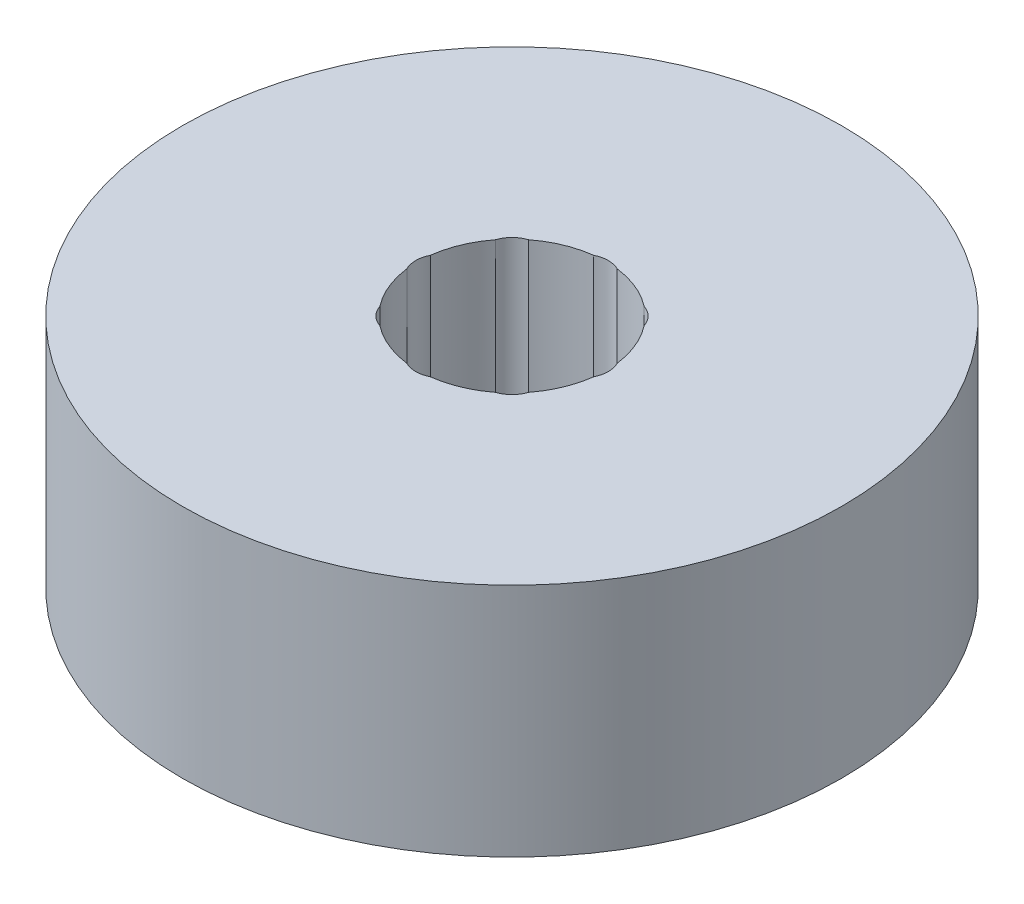
ISO-10303-21;
HEADER;
FILE_DESCRIPTION(('STEP AP214'),'2;1');
FILE_NAME('part.step','',(''),(''),'','','');
FILE_SCHEMA(('AUTOMOTIVE_DESIGN { 1 0 10303 214 1 1 1 1 }'));
ENDSEC;
DATA;
#1=APPLICATION_CONTEXT('core data for automotive mechanical design processes');
#2=APPLICATION_PROTOCOL_DEFINITION('international standard','automotive_design',2000,#1);
#3=PRODUCT_CONTEXT('',#1,'mechanical');
#4=PRODUCT('Part','Part','',(#3));
#5=PRODUCT_RELATED_PRODUCT_CATEGORY('part','',(#4));
#6=PRODUCT_DEFINITION_FORMATION('','',#4);
#7=PRODUCT_DEFINITION_CONTEXT('part definition',#1,'design');
#8=PRODUCT_DEFINITION('design','',#6,#7);
#9=PRODUCT_DEFINITION_SHAPE('','',#8);
#10=(LENGTH_UNIT() NAMED_UNIT(*) SI_UNIT(.MILLI.,.METRE.));
#11=(NAMED_UNIT(*) PLANE_ANGLE_UNIT() SI_UNIT($,.RADIAN.));
#12=(NAMED_UNIT(*) SI_UNIT($,.STERADIAN.) SOLID_ANGLE_UNIT());
#13=UNCERTAINTY_MEASURE_WITH_UNIT(LENGTH_MEASURE(1.E-05),#10,'distance_accuracy_value','');
#14=(GEOMETRIC_REPRESENTATION_CONTEXT(3) GLOBAL_UNCERTAINTY_ASSIGNED_CONTEXT((#13)) GLOBAL_UNIT_ASSIGNED_CONTEXT((#10,
#11,#12)) REPRESENTATION_CONTEXT('',''));
#15=CARTESIAN_POINT('',(0.,0.,0.));
#16=DIRECTION('',(0.,0.,1.));
#17=DIRECTION('',(1.,0.,0.));
#18=AXIS2_PLACEMENT_3D('',#15,#16,#17);
#19=CARTESIAN_POINT('',(0.,25.,0.));
#20=DIRECTION('',(0.,-1.,0.));
#21=DIRECTION('',(0.,0.,-1.));
#22=AXIS2_PLACEMENT_3D('',#19,#20,#21);
#23=CYLINDRICAL_SURFACE('',#22,35.);
#24=CARTESIAN_POINT('',(0.,25.,0.));
#25=DIRECTION('',(0.,1.,0.));
#26=DIRECTION('',(0.,0.,1.));
#27=AXIS2_PLACEMENT_3D('',#24,#25,#26);
#28=CIRCLE('',#27,35.);
#29=CARTESIAN_POINT('',(0.,25.,35.));
#30=VERTEX_POINT('',#29);
#31=EDGE_CURVE('E190',#30,#30,#28,.T.);
#32=ORIENTED_EDGE('',*,*,#31,.F.);
#33=EDGE_LOOP('',(#32));
#34=FACE_BOUND('',#33,.T.);
#35=CARTESIAN_POINT('',(0.,0.,0.));
#36=DIRECTION('',(0.,1.,0.));
#37=DIRECTION('',(0.,0.,1.));
#38=AXIS2_PLACEMENT_3D('',#35,#36,#37);
#39=CIRCLE('',#38,35.);
#40=CARTESIAN_POINT('',(0.,0.,35.));
#41=VERTEX_POINT('',#40);
#42=EDGE_CURVE('E181',#41,#41,#39,.T.);
#43=ORIENTED_EDGE('',*,*,#42,.T.);
#44=EDGE_LOOP('',(#43));
#45=FACE_BOUND('',#44,.T.);
#46=ADVANCED_FACE('F39',(#34,#45),#23,.T.);
#47=CARTESIAN_POINT('',(0.,25.,0.));
#48=DIRECTION('',(0.,1.,0.));
#49=DIRECTION('',(0.,0.,1.));
#50=AXIS2_PLACEMENT_3D('',#47,#48,#49);
#51=PLANE('',#50);
#52=CARTESIAN_POINT('',(7.44047920707784,25.,0.));
#53=DIRECTION('',(0.,1.,0.));
#54=DIRECTION('',(0.,0.,-1.));
#55=AXIS2_PLACEMENT_3D('',#52,#53,#54);
#56=CIRCLE('',#55,2.77739005515061);
#57=CARTESIAN_POINT('',(9.92186331036699,25.,1.24764916959594));
#58=VERTEX_POINT('',#57);
#59=CARTESIAN_POINT('',(9.92186331036699,25.,-1.24764916959594));
#60=VERTEX_POINT('',#59);
#61=EDGE_CURVE('E257',#58,#60,#56,.T.);
#62=ORIENTED_EDGE('',*,*,#61,.F.);
#63=CARTESIAN_POINT('',(0.,25.,0.));
#64=DIRECTION('',(0.,1.,0.));
#65=DIRECTION('',(0.,0.,1.));
#66=AXIS2_PLACEMENT_3D('',#63,#64,#65);
#67=CIRCLE('',#66,10.);
#68=CARTESIAN_POINT('',(7.89803801712959,25.,6.13359564040341));
#69=VERTEX_POINT('',#68);
#70=EDGE_CURVE('E336',#69,#58,#67,.T.);
#71=ORIENTED_EDGE('',*,*,#70,.F.);
#72=CARTESIAN_POINT('',(5.26121330260227,25.,5.26121330260222));
#73=DIRECTION('',(0.,1.,0.));
#74=DIRECTION('',(0.707106781186544,0.,-0.707106781186551));
#75=AXIS2_PLACEMENT_3D('',#72,#73,#74);
#76=CIRCLE('',#75,2.77739005515061);
#77=CARTESIAN_POINT('',(6.13359564040349,25.,7.89803801712952));
#78=VERTEX_POINT('',#77);
#79=EDGE_CURVE('E327',#78,#69,#76,.T.);
#80=ORIENTED_EDGE('',*,*,#79,.F.);
#81=CARTESIAN_POINT('',(1.24764916959597,25.,9.92186331036699));
#82=VERTEX_POINT('',#81);
#83=EDGE_CURVE('E188',#82,#78,#67,.T.);
#84=ORIENTED_EDGE('',*,*,#83,.F.);
#85=CARTESIAN_POINT('',(0.,25.,7.44047920707784));
#86=DIRECTION('',(0.,1.,0.));
#87=DIRECTION('',(1.,0.,0.));
#88=AXIS2_PLACEMENT_3D('',#85,#86,#87);
#89=CIRCLE('',#88,2.77739005515061);
#90=CARTESIAN_POINT('',(-1.2476491695959,25.,9.92186331036699));
#91=VERTEX_POINT('',#90);
#92=EDGE_CURVE('E330',#91,#82,#89,.T.);
#93=ORIENTED_EDGE('',*,*,#92,.F.);
#94=CARTESIAN_POINT('',(-6.13359564040344,25.,7.89803801712957));
#95=VERTEX_POINT('',#94);
#96=EDGE_CURVE('E172',#95,#91,#67,.T.);
#97=ORIENTED_EDGE('',*,*,#96,.F.);
#98=CARTESIAN_POINT('',(-5.26121330260224,25.,5.26121330260225));
#99=DIRECTION('',(0.,1.,0.));
#100=DIRECTION('',(0.707106781186549,0.,0.707106781186546));
#101=AXIS2_PLACEMENT_3D('',#98,#99,#100);
#102=CIRCLE('',#101,2.77739005515061);
#103=CARTESIAN_POINT('',(-7.89803801712954,25.,6.13359564040347));
#104=VERTEX_POINT('',#103);
#105=EDGE_CURVE('E152',#104,#95,#102,.T.);
#106=ORIENTED_EDGE('',*,*,#105,.F.);
#107=CARTESIAN_POINT('',(-9.92186331036699,25.,1.24764916959594));
#108=VERTEX_POINT('',#107);
#109=EDGE_CURVE('E168',#108,#104,#67,.T.);
#110=ORIENTED_EDGE('',*,*,#109,.F.);
#111=CARTESIAN_POINT('',(-7.44047920707784,25.,0.));
#112=DIRECTION('',(0.,1.,0.));
#113=DIRECTION('',(0.,0.,1.));
#114=AXIS2_PLACEMENT_3D('',#111,#112,#113);
#115=CIRCLE('',#114,2.77739005515061);
#116=CARTESIAN_POINT('',(-9.92186331036699,25.,-1.24764916959594));
#117=VERTEX_POINT('',#116);
#118=EDGE_CURVE('E204',#117,#108,#115,.T.);
#119=ORIENTED_EDGE('',*,*,#118,.F.);
#120=CARTESIAN_POINT('',(-7.89803801712963,25.,-6.13359564040336));
#121=VERTEX_POINT('',#120);
#122=EDGE_CURVE('E183',#121,#117,#67,.T.);
#123=ORIENTED_EDGE('',*,*,#122,.F.);
#124=CARTESIAN_POINT('',(-5.26121330260231,25.,-5.26121330260218));
#125=DIRECTION('',(0.,1.,0.));
#126=DIRECTION('',(-0.707106781186539,0.,0.707106781186556));
#127=AXIS2_PLACEMENT_3D('',#124,#125,#126);
#128=CIRCLE('',#127,2.77739005515061);
#129=CARTESIAN_POINT('',(-6.13359564040355,25.,-7.89803801712948));
#130=VERTEX_POINT('',#129);
#131=EDGE_CURVE('E347',#130,#121,#128,.T.);
#132=ORIENTED_EDGE('',*,*,#131,.F.);
#133=CARTESIAN_POINT('',(-1.24764916959604,25.,-9.92186331036697));
#134=VERTEX_POINT('',#133);
#135=EDGE_CURVE('E195',#134,#130,#67,.T.);
#136=ORIENTED_EDGE('',*,*,#135,.F.);
#137=CARTESIAN_POINT('',(0.,25.,-7.44047920707784));
#138=DIRECTION('',(0.,1.,0.));
#139=DIRECTION('',(-1.,0.,0.));
#140=AXIS2_PLACEMENT_3D('',#137,#138,#139);
#141=CIRCLE('',#140,2.77739005515061);
#142=CARTESIAN_POINT('',(1.24764916959583,25.,-9.921863310367));
#143=VERTEX_POINT('',#142);
#144=EDGE_CURVE('E360',#143,#134,#141,.T.);
#145=ORIENTED_EDGE('',*,*,#144,.F.);
#146=CARTESIAN_POINT('',(6.13359564040339,25.,-7.89803801712961));
#147=VERTEX_POINT('',#146);
#148=EDGE_CURVE('E200',#147,#143,#67,.T.);
#149=ORIENTED_EDGE('',*,*,#148,.F.);
#150=CARTESIAN_POINT('',(5.2612133026022,25.,-5.26121330260229));
#151=DIRECTION('',(0.,1.,0.));
#152=DIRECTION('',(-0.707106781186554,0.,-0.707106781186541));
#153=AXIS2_PLACEMENT_3D('',#150,#151,#152);
#154=CIRCLE('',#153,2.77739005515061);
#155=CARTESIAN_POINT('',(7.8980380171295,25.,-6.13359564040352));
#156=VERTEX_POINT('',#155);
#157=EDGE_CURVE('E363',#156,#147,#154,.T.);
#158=ORIENTED_EDGE('',*,*,#157,.F.);
#159=EDGE_CURVE('E367',#60,#156,#67,.T.);
#160=ORIENTED_EDGE('',*,*,#159,.F.);
#161=EDGE_LOOP('',(#62,#71,#80,#84,#93,#97,#106,#110,#119,#123,#132,#136,#145,#149,#158,#160));
#162=FACE_BOUND('',#161,.T.);
#163=ORIENTED_EDGE('',*,*,#31,.T.);
#164=EDGE_LOOP('',(#163));
#165=FACE_BOUND('',#164,.T.);
#166=ADVANCED_FACE('F170',(#162,#165),#51,.T.);
#167=CARTESIAN_POINT('',(0.,0.,0.));
#168=DIRECTION('',(0.,1.,0.));
#169=DIRECTION('',(0.,0.,1.));
#170=AXIS2_PLACEMENT_3D('',#167,#168,#169);
#171=PLANE('',#170);
#172=CARTESIAN_POINT('',(0.,0.,0.));
#173=DIRECTION('',(0.,1.,0.));
#174=DIRECTION('',(0.,0.,1.));
#175=AXIS2_PLACEMENT_3D('',#172,#173,#174);
#176=CIRCLE('',#175,10.);
#177=CARTESIAN_POINT('',(0.,0.,10.));
#178=VERTEX_POINT('',#177);
#179=EDGE_CURVE('E192',#178,#178,#176,.T.);
#180=ORIENTED_EDGE('',*,*,#179,.T.);
#181=EDGE_LOOP('',(#180));
#182=FACE_BOUND('',#181,.T.);
#183=ORIENTED_EDGE('',*,*,#42,.F.);
#184=EDGE_LOOP('',(#183));
#185=FACE_BOUND('',#184,.T.);
#186=ADVANCED_FACE('F276',(#182,#185),#171,.F.);
#187=CARTESIAN_POINT('',(0.,25.,0.));
#188=DIRECTION('',(0.,-1.,0.));
#189=DIRECTION('',(0.,0.,-1.));
#190=AXIS2_PLACEMENT_3D('',#187,#188,#189);
#191=CYLINDRICAL_SURFACE('',#190,10.);
#192=DIRECTION('',(0.,1.,0.));
#193=VECTOR('',#192,1.);
#194=CARTESIAN_POINT('',(9.92186331036699,15.818184822182,1.24764916959594));
#195=LINE('',#194,#193);
#196=CARTESIAN_POINT('',(9.92186331036699,6.63636964436409,1.24764916959594));
#197=VERTEX_POINT('',#196);
#198=EDGE_CURVE('E11',#197,#58,#195,.T.);
#199=ORIENTED_EDGE('',*,*,#198,.F.);
#200=CARTESIAN_POINT('',(0.,6.63636964436409,0.));
#201=DIRECTION('',(0.,1.,0.));
#202=DIRECTION('',(0.,0.,1.));
#203=AXIS2_PLACEMENT_3D('',#200,#201,#202);
#204=CIRCLE('',#203,10.);
#205=CARTESIAN_POINT('',(9.92186331036699,6.63636964436409,-1.24764916959594));
#206=VERTEX_POINT('',#205);
#207=EDGE_CURVE('E254',#197,#206,#204,.T.);
#208=ORIENTED_EDGE('',*,*,#207,.T.);
#209=DIRECTION('',(0.,1.,0.));
#210=VECTOR('',#209,1.);
#211=CARTESIAN_POINT('',(9.92186331036699,15.818184822182,-1.24764916959594));
#212=LINE('',#211,#210);
#213=EDGE_CURVE('E46',#60,#206,#212,.F.);
#214=ORIENTED_EDGE('',*,*,#213,.F.);
#215=ORIENTED_EDGE('',*,*,#159,.T.);
#216=DIRECTION('',(0.,1.,0.));
#217=VECTOR('',#216,1.);
#218=CARTESIAN_POINT('',(7.8980380171295,15.818184822182,-6.13359564040352));
#219=LINE('',#218,#217);
#220=CARTESIAN_POINT('',(7.8980380171295,6.63636964436409,-6.13359564040352));
#221=VERTEX_POINT('',#220);
#222=EDGE_CURVE('E251',#221,#156,#219,.T.);
#223=ORIENTED_EDGE('',*,*,#222,.F.);
#224=CARTESIAN_POINT('',(0.,6.63636964436409,0.));
#225=DIRECTION('',(0.,1.,0.));
#226=DIRECTION('',(0.,0.,1.));
#227=AXIS2_PLACEMENT_3D('',#224,#225,#226);
#228=CIRCLE('',#227,10.);
#229=CARTESIAN_POINT('',(6.13359564040339,6.63636964436409,-7.89803801712961));
#230=VERTEX_POINT('',#229);
#231=EDGE_CURVE('E247',#221,#230,#228,.T.);
#232=ORIENTED_EDGE('',*,*,#231,.T.);
#233=DIRECTION('',(0.,1.,0.));
#234=VECTOR('',#233,1.);
#235=CARTESIAN_POINT('',(6.13359564040338,15.818184822182,-7.89803801712961));
#236=LINE('',#235,#234);
#237=EDGE_CURVE('E253',#147,#230,#236,.F.);
#238=ORIENTED_EDGE('',*,*,#237,.F.);
#239=ORIENTED_EDGE('',*,*,#148,.T.);
#240=DIRECTION('',(0.,1.,0.));
#241=VECTOR('',#240,1.);
#242=CARTESIAN_POINT('',(1.24764916959583,15.818184822182,-9.921863310367));
#243=LINE('',#242,#241);
#244=CARTESIAN_POINT('',(1.24764916959583,6.63636964436409,-9.921863310367));
#245=VERTEX_POINT('',#244);
#246=EDGE_CURVE('E225',#245,#143,#243,.T.);
#247=ORIENTED_EDGE('',*,*,#246,.F.);
#248=CARTESIAN_POINT('',(0.,6.63636964436409,0.));
#249=DIRECTION('',(0.,1.,0.));
#250=DIRECTION('',(0.,0.,1.));
#251=AXIS2_PLACEMENT_3D('',#248,#249,#250);
#252=CIRCLE('',#251,10.);
#253=CARTESIAN_POINT('',(-1.24764916959604,6.63636964436409,-9.92186331036697));
#254=VERTEX_POINT('',#253);
#255=EDGE_CURVE('E159',#245,#254,#252,.T.);
#256=ORIENTED_EDGE('',*,*,#255,.T.);
#257=DIRECTION('',(0.,1.,0.));
#258=VECTOR('',#257,1.);
#259=CARTESIAN_POINT('',(-1.24764916959604,15.818184822182,-9.92186331036697));
#260=LINE('',#259,#258);
#261=EDGE_CURVE('E218',#134,#254,#260,.F.);
#262=ORIENTED_EDGE('',*,*,#261,.F.);
#263=ORIENTED_EDGE('',*,*,#135,.T.);
#264=DIRECTION('',(0.,1.,0.));
#265=VECTOR('',#264,1.);
#266=CARTESIAN_POINT('',(-6.13359564040355,15.818184822182,-7.89803801712948));
#267=LINE('',#266,#265);
#268=CARTESIAN_POINT('',(-6.13359564040355,6.63636964436409,-7.89803801712948));
#269=VERTEX_POINT('',#268);
#270=EDGE_CURVE('E229',#269,#130,#267,.T.);
#271=ORIENTED_EDGE('',*,*,#270,.F.);
#272=CARTESIAN_POINT('',(0.,6.63636964436409,0.));
#273=DIRECTION('',(0.,1.,0.));
#274=DIRECTION('',(0.,0.,1.));
#275=AXIS2_PLACEMENT_3D('',#272,#273,#274);
#276=CIRCLE('',#275,10.);
#277=CARTESIAN_POINT('',(-7.89803801712963,6.63636964436409,-6.13359564040336));
#278=VERTEX_POINT('',#277);
#279=EDGE_CURVE('E221',#269,#278,#276,.T.);
#280=ORIENTED_EDGE('',*,*,#279,.T.);
#281=DIRECTION('',(0.,1.,0.));
#282=VECTOR('',#281,1.);
#283=CARTESIAN_POINT('',(-7.89803801712963,15.818184822182,-6.13359564040336));
#284=LINE('',#283,#282);
#285=EDGE_CURVE('E230',#121,#278,#284,.F.);
#286=ORIENTED_EDGE('',*,*,#285,.F.);
#287=ORIENTED_EDGE('',*,*,#122,.T.);
#288=DIRECTION('',(0.,1.,0.));
#289=VECTOR('',#288,1.);
#290=CARTESIAN_POINT('',(-9.92186331036699,15.818184822182,-1.24764916959594));
#291=LINE('',#290,#289);
#292=CARTESIAN_POINT('',(-9.92186331036699,6.63636964436409,-1.24764916959594));
#293=VERTEX_POINT('',#292);
#294=EDGE_CURVE('E215',#293,#117,#291,.T.);
#295=ORIENTED_EDGE('',*,*,#294,.F.);
#296=CARTESIAN_POINT('',(0.,6.63636964436409,0.));
#297=DIRECTION('',(0.,1.,0.));
#298=DIRECTION('',(0.,0.,1.));
#299=AXIS2_PLACEMENT_3D('',#296,#297,#298);
#300=CIRCLE('',#299,10.);
#301=CARTESIAN_POINT('',(-9.92186331036699,6.63636964436409,1.24764916959594));
#302=VERTEX_POINT('',#301);
#303=EDGE_CURVE('E208',#293,#302,#300,.T.);
#304=ORIENTED_EDGE('',*,*,#303,.T.);
#305=DIRECTION('',(0.,1.,0.));
#306=VECTOR('',#305,1.);
#307=CARTESIAN_POINT('',(-9.92186331036699,15.818184822182,1.24764916959594));
#308=LINE('',#307,#306);
#309=EDGE_CURVE('E185',#108,#302,#308,.F.);
#310=ORIENTED_EDGE('',*,*,#309,.F.);
#311=ORIENTED_EDGE('',*,*,#109,.T.);
#312=DIRECTION('',(0.,1.,0.));
#313=VECTOR('',#312,1.);
#314=CARTESIAN_POINT('',(-7.89803801712955,15.818184822182,6.13359564040347));
#315=LINE('',#314,#313);
#316=CARTESIAN_POINT('',(-7.89803801712954,6.63636964436409,6.13359564040347));
#317=VERTEX_POINT('',#316);
#318=EDGE_CURVE('E147',#317,#104,#315,.T.);
#319=ORIENTED_EDGE('',*,*,#318,.F.);
#320=CARTESIAN_POINT('',(0.,6.63636964436409,0.));
#321=DIRECTION('',(0.,1.,0.));
#322=DIRECTION('',(0.,0.,1.));
#323=AXIS2_PLACEMENT_3D('',#320,#321,#322);
#324=CIRCLE('',#323,10.);
#325=CARTESIAN_POINT('',(-6.13359564040344,6.63636964436409,7.89803801712957));
#326=VERTEX_POINT('',#325);
#327=EDGE_CURVE('E212',#317,#326,#324,.T.);
#328=ORIENTED_EDGE('',*,*,#327,.T.);
#329=DIRECTION('',(0.,1.,0.));
#330=VECTOR('',#329,1.);
#331=CARTESIAN_POINT('',(-6.13359564040344,15.818184822182,7.89803801712957));
#332=LINE('',#331,#330);
#333=EDGE_CURVE('E161',#95,#326,#332,.F.);
#334=ORIENTED_EDGE('',*,*,#333,.F.);
#335=ORIENTED_EDGE('',*,*,#96,.T.);
#336=DIRECTION('',(0.,1.,0.));
#337=VECTOR('',#336,1.);
#338=CARTESIAN_POINT('',(-1.2476491695959,15.818184822182,9.92186331036699));
#339=LINE('',#338,#337);
#340=CARTESIAN_POINT('',(-1.2476491695959,6.63636964436409,9.92186331036699));
#341=VERTEX_POINT('',#340);
#342=EDGE_CURVE('E246',#341,#91,#339,.T.);
#343=ORIENTED_EDGE('',*,*,#342,.F.);
#344=CARTESIAN_POINT('',(0.,6.63636964436409,0.));
#345=DIRECTION('',(0.,1.,0.));
#346=DIRECTION('',(0.,0.,1.));
#347=AXIS2_PLACEMENT_3D('',#344,#345,#346);
#348=CIRCLE('',#347,10.);
#349=CARTESIAN_POINT('',(1.24764916959597,6.63636964436409,9.92186331036699));
#350=VERTEX_POINT('',#349);
#351=EDGE_CURVE('E238',#341,#350,#348,.T.);
#352=ORIENTED_EDGE('',*,*,#351,.T.);
#353=DIRECTION('',(0.,1.,0.));
#354=VECTOR('',#353,1.);
#355=CARTESIAN_POINT('',(1.24764916959597,15.818184822182,9.92186331036698));
#356=LINE('',#355,#354);
#357=EDGE_CURVE('E242',#82,#350,#356,.F.);
#358=ORIENTED_EDGE('',*,*,#357,.F.);
#359=ORIENTED_EDGE('',*,*,#83,.T.);
#360=DIRECTION('',(0.,1.,0.));
#361=VECTOR('',#360,1.);
#362=CARTESIAN_POINT('',(6.13359564040349,15.818184822182,7.89803801712953));
#363=LINE('',#362,#361);
#364=CARTESIAN_POINT('',(6.13359564040349,6.63636964436409,7.89803801712952));
#365=VERTEX_POINT('',#364);
#366=EDGE_CURVE('E236',#365,#78,#363,.T.);
#367=ORIENTED_EDGE('',*,*,#366,.F.);
#368=CARTESIAN_POINT('',(0.,6.63636964436409,0.));
#369=DIRECTION('',(0.,1.,0.));
#370=DIRECTION('',(0.,0.,1.));
#371=AXIS2_PLACEMENT_3D('',#368,#369,#370);
#372=CIRCLE('',#371,10.);
#373=CARTESIAN_POINT('',(7.89803801712959,6.63636964436409,6.13359564040341));
#374=VERTEX_POINT('',#373);
#375=EDGE_CURVE('E235',#365,#374,#372,.T.);
#376=ORIENTED_EDGE('',*,*,#375,.T.);
#377=DIRECTION('',(0.,1.,0.));
#378=VECTOR('',#377,1.);
#379=CARTESIAN_POINT('',(7.89803801712959,15.818184822182,6.13359564040341));
#380=LINE('',#379,#378);
#381=EDGE_CURVE('E234',#69,#374,#380,.F.);
#382=ORIENTED_EDGE('',*,*,#381,.F.);
#383=ORIENTED_EDGE('',*,*,#70,.T.);
#384=EDGE_LOOP('',(#199,#208,#214,#215,#223,#232,#238,#239,#247,#256,#262,#263,#271,#280,#286,
#287,#295,#304,#310,#311,#319,#328,#334,#335,#343,#352,#358,#359,#367,#376,#382,#383));
#385=FACE_BOUND('',#384,.T.);
#386=ORIENTED_EDGE('',*,*,#179,.F.);
#387=EDGE_LOOP('',(#386));
#388=FACE_BOUND('',#387,.T.);
#389=ADVANCED_FACE('F177',(#385,#388),#191,.F.);
#390=CARTESIAN_POINT('',(-7.44047920707784,6.63636964436409,0.));
#391=DIRECTION('',(0.,1.,0.));
#392=DIRECTION('',(0.,0.,1.));
#393=AXIS2_PLACEMENT_3D('',#390,#391,#392);
#394=CYLINDRICAL_SURFACE('',#393,2.77739005515061);
#395=ORIENTED_EDGE('',*,*,#294,.T.);
#396=ORIENTED_EDGE('',*,*,#118,.T.);
#397=ORIENTED_EDGE('',*,*,#309,.T.);
#398=CARTESIAN_POINT('',(-7.44047920707784,6.63636964436409,0.));
#399=DIRECTION('',(0.,1.,0.));
#400=DIRECTION('',(0.,0.,1.));
#401=AXIS2_PLACEMENT_3D('',#398,#399,#400);
#402=CIRCLE('',#401,2.77739005515061);
#403=EDGE_CURVE('E203',#293,#302,#402,.T.);
#404=ORIENTED_EDGE('',*,*,#403,.F.);
#405=EDGE_LOOP('',(#395,#396,#397,#404));
#406=FACE_BOUND('',#405,.T.);
#407=ADVANCED_FACE('F288',(#406),#394,.F.);
#408=CARTESIAN_POINT('',(-7.44047920707784,6.63636964436409,0.));
#409=DIRECTION('',(0.,1.,0.));
#410=DIRECTION('',(0.,0.,1.));
#411=AXIS2_PLACEMENT_3D('',#408,#409,#410);
#412=PLANE('',#411);
#413=ORIENTED_EDGE('',*,*,#403,.T.);
#414=ORIENTED_EDGE('',*,*,#303,.F.);
#415=EDGE_LOOP('',(#413,#414));
#416=FACE_BOUND('',#415,.T.);
#417=ADVANCED_FACE('F291',(#416),#412,.T.);
#418=CARTESIAN_POINT('',(-5.26121330260224,6.63636964436409,5.26121330260225));
#419=DIRECTION('',(0.,1.,0.));
#420=DIRECTION('',(0.,0.,1.));
#421=AXIS2_PLACEMENT_3D('',#418,#419,#420);
#422=CYLINDRICAL_SURFACE('',#421,2.77739005515061);
#423=ORIENTED_EDGE('',*,*,#318,.T.);
#424=ORIENTED_EDGE('',*,*,#105,.T.);
#425=ORIENTED_EDGE('',*,*,#333,.T.);
#426=CARTESIAN_POINT('',(-5.26121330260224,6.63636964436409,5.26121330260225));
#427=DIRECTION('',(0.,1.,0.));
#428=DIRECTION('',(0.707106781186549,0.,0.707106781186546));
#429=AXIS2_PLACEMENT_3D('',#426,#427,#428);
#430=CIRCLE('',#429,2.77739005515061);
#431=EDGE_CURVE('E156',#317,#326,#430,.T.);
#432=ORIENTED_EDGE('',*,*,#431,.F.);
#433=EDGE_LOOP('',(#423,#424,#425,#432));
#434=FACE_BOUND('',#433,.T.);
#435=ADVANCED_FACE('F155',(#434),#422,.F.);
#436=CARTESIAN_POINT('',(-5.26121330260224,6.63636964436409,5.26121330260225));
#437=DIRECTION('',(0.,1.,0.));
#438=DIRECTION('',(0.707106781186549,0.,0.707106781186546));
#439=AXIS2_PLACEMENT_3D('',#436,#437,#438);
#440=PLANE('',#439);
#441=ORIENTED_EDGE('',*,*,#431,.T.);
#442=ORIENTED_EDGE('',*,*,#327,.F.);
#443=EDGE_LOOP('',(#441,#442));
#444=FACE_BOUND('',#443,.T.);
#445=ADVANCED_FACE('F299',(#444),#440,.T.);
#446=CARTESIAN_POINT('',(0.,6.63636964436409,-7.44047920707784));
#447=DIRECTION('',(0.,1.,0.));
#448=DIRECTION('',(0.,0.,1.));
#449=AXIS2_PLACEMENT_3D('',#446,#447,#448);
#450=CYLINDRICAL_SURFACE('',#449,2.77739005515061);
#451=ORIENTED_EDGE('',*,*,#246,.T.);
#452=ORIENTED_EDGE('',*,*,#144,.T.);
#453=ORIENTED_EDGE('',*,*,#261,.T.);
#454=CARTESIAN_POINT('',(0.,6.63636964436409,-7.44047920707784));
#455=DIRECTION('',(0.,1.,0.));
#456=DIRECTION('',(-1.,0.,0.));
#457=AXIS2_PLACEMENT_3D('',#454,#455,#456);
#458=CIRCLE('',#457,2.77739005515061);
#459=EDGE_CURVE('E356',#245,#254,#458,.T.);
#460=ORIENTED_EDGE('',*,*,#459,.F.);
#461=EDGE_LOOP('',(#451,#452,#453,#460));
#462=FACE_BOUND('',#461,.T.);
#463=ADVANCED_FACE('F302',(#462),#450,.F.);
#464=CARTESIAN_POINT('',(0.,6.63636964436409,-7.44047920707784));
#465=DIRECTION('',(0.,1.,0.));
#466=DIRECTION('',(-1.,0.,0.));
#467=AXIS2_PLACEMENT_3D('',#464,#465,#466);
#468=PLANE('',#467);
#469=ORIENTED_EDGE('',*,*,#459,.T.);
#470=ORIENTED_EDGE('',*,*,#255,.F.);
#471=EDGE_LOOP('',(#469,#470));
#472=FACE_BOUND('',#471,.T.);
#473=ADVANCED_FACE('F377',(#472),#468,.T.);
#474=CARTESIAN_POINT('',(-5.26121330260231,6.63636964436409,-5.26121330260218));
#475=DIRECTION('',(0.,1.,0.));
#476=DIRECTION('',(0.,0.,1.));
#477=AXIS2_PLACEMENT_3D('',#474,#475,#476);
#478=CYLINDRICAL_SURFACE('',#477,2.77739005515061);
#479=ORIENTED_EDGE('',*,*,#270,.T.);
#480=ORIENTED_EDGE('',*,*,#131,.T.);
#481=ORIENTED_EDGE('',*,*,#285,.T.);
#482=CARTESIAN_POINT('',(-5.26121330260231,6.63636964436409,-5.26121330260218));
#483=DIRECTION('',(0.,1.,0.));
#484=DIRECTION('',(-0.707106781186539,0.,0.707106781186556));
#485=AXIS2_PLACEMENT_3D('',#482,#483,#484);
#486=CIRCLE('',#485,2.77739005515061);
#487=EDGE_CURVE('E349',#269,#278,#486,.T.);
#488=ORIENTED_EDGE('',*,*,#487,.F.);
#489=EDGE_LOOP('',(#479,#480,#481,#488));
#490=FACE_BOUND('',#489,.T.);
#491=ADVANCED_FACE('F385',(#490),#478,.F.);
#492=CARTESIAN_POINT('',(-5.26121330260231,6.63636964436409,-5.26121330260218));
#493=DIRECTION('',(0.,1.,0.));
#494=DIRECTION('',(-0.707106781186539,0.,0.707106781186556));
#495=AXIS2_PLACEMENT_3D('',#492,#493,#494);
#496=PLANE('',#495);
#497=ORIENTED_EDGE('',*,*,#487,.T.);
#498=ORIENTED_EDGE('',*,*,#279,.F.);
#499=EDGE_LOOP('',(#497,#498));
#500=FACE_BOUND('',#499,.T.);
#501=ADVANCED_FACE('F318',(#500),#496,.T.);
#502=CARTESIAN_POINT('',(5.26121330260227,6.63636964436409,5.26121330260222));
#503=DIRECTION('',(0.,1.,0.));
#504=DIRECTION('',(0.,0.,1.));
#505=AXIS2_PLACEMENT_3D('',#502,#503,#504);
#506=CYLINDRICAL_SURFACE('',#505,2.77739005515061);
#507=ORIENTED_EDGE('',*,*,#366,.T.);
#508=ORIENTED_EDGE('',*,*,#79,.T.);
#509=ORIENTED_EDGE('',*,*,#381,.T.);
#510=CARTESIAN_POINT('',(5.26121330260227,6.63636964436409,5.26121330260222));
#511=DIRECTION('',(0.,1.,0.));
#512=DIRECTION('',(0.707106781186544,0.,-0.707106781186551));
#513=AXIS2_PLACEMENT_3D('',#510,#511,#512);
#514=CIRCLE('',#513,2.77739005515061);
#515=EDGE_CURVE('E324',#365,#374,#514,.T.);
#516=ORIENTED_EDGE('',*,*,#515,.F.);
#517=EDGE_LOOP('',(#507,#508,#509,#516));
#518=FACE_BOUND('',#517,.T.);
#519=ADVANCED_FACE('F312',(#518),#506,.F.);
#520=CARTESIAN_POINT('',(5.26121330260227,6.63636964436409,5.26121330260222));
#521=DIRECTION('',(0.,1.,0.));
#522=DIRECTION('',(0.707106781186544,0.,-0.707106781186551));
#523=AXIS2_PLACEMENT_3D('',#520,#521,#522);
#524=PLANE('',#523);
#525=ORIENTED_EDGE('',*,*,#515,.T.);
#526=ORIENTED_EDGE('',*,*,#375,.F.);
#527=EDGE_LOOP('',(#525,#526));
#528=FACE_BOUND('',#527,.T.);
#529=ADVANCED_FACE('F310',(#528),#524,.T.);
#530=CARTESIAN_POINT('',(0.,6.63636964436409,7.44047920707784));
#531=DIRECTION('',(0.,1.,0.));
#532=DIRECTION('',(0.,0.,1.));
#533=AXIS2_PLACEMENT_3D('',#530,#531,#532);
#534=CYLINDRICAL_SURFACE('',#533,2.77739005515061);
#535=ORIENTED_EDGE('',*,*,#342,.T.);
#536=ORIENTED_EDGE('',*,*,#92,.T.);
#537=ORIENTED_EDGE('',*,*,#357,.T.);
#538=CARTESIAN_POINT('',(0.,6.63636964436409,7.44047920707784));
#539=DIRECTION('',(0.,1.,0.));
#540=DIRECTION('',(1.,0.,0.));
#541=AXIS2_PLACEMENT_3D('',#538,#539,#540);
#542=CIRCLE('',#541,2.77739005515061);
#543=EDGE_CURVE('E173',#341,#350,#542,.T.);
#544=ORIENTED_EDGE('',*,*,#543,.F.);
#545=EDGE_LOOP('',(#535,#536,#537,#544));
#546=FACE_BOUND('',#545,.T.);
#547=ADVANCED_FACE('F304',(#546),#534,.F.);
#548=CARTESIAN_POINT('',(0.,6.63636964436409,7.44047920707784));
#549=DIRECTION('',(0.,1.,0.));
#550=DIRECTION('',(1.,0.,0.));
#551=AXIS2_PLACEMENT_3D('',#548,#549,#550);
#552=PLANE('',#551);
#553=ORIENTED_EDGE('',*,*,#543,.T.);
#554=ORIENTED_EDGE('',*,*,#351,.F.);
#555=EDGE_LOOP('',(#553,#554));
#556=FACE_BOUND('',#555,.T.);
#557=ADVANCED_FACE('F306',(#556),#552,.T.);
#558=CARTESIAN_POINT('',(5.2612133026022,6.63636964436409,-5.26121330260229));
#559=DIRECTION('',(0.,1.,0.));
#560=DIRECTION('',(0.,0.,1.));
#561=AXIS2_PLACEMENT_3D('',#558,#559,#560);
#562=CYLINDRICAL_SURFACE('',#561,2.77739005515061);
#563=ORIENTED_EDGE('',*,*,#222,.T.);
#564=ORIENTED_EDGE('',*,*,#157,.T.);
#565=ORIENTED_EDGE('',*,*,#237,.T.);
#566=CARTESIAN_POINT('',(5.2612133026022,6.63636964436409,-5.26121330260229));
#567=DIRECTION('',(0.,1.,0.));
#568=DIRECTION('',(-0.707106781186554,0.,-0.707106781186541));
#569=AXIS2_PLACEMENT_3D('',#566,#567,#568);
#570=CIRCLE('',#569,2.77739005515061);
#571=EDGE_CURVE('E56',#221,#230,#570,.T.);
#572=ORIENTED_EDGE('',*,*,#571,.F.);
#573=EDGE_LOOP('',(#563,#564,#565,#572));
#574=FACE_BOUND('',#573,.T.);
#575=ADVANCED_FACE('F311',(#574),#562,.F.);
#576=CARTESIAN_POINT('',(5.2612133026022,6.63636964436409,-5.26121330260229));
#577=DIRECTION('',(0.,1.,0.));
#578=DIRECTION('',(-0.707106781186554,0.,-0.707106781186541));
#579=AXIS2_PLACEMENT_3D('',#576,#577,#578);
#580=PLANE('',#579);
#581=ORIENTED_EDGE('',*,*,#571,.T.);
#582=ORIENTED_EDGE('',*,*,#231,.F.);
#583=EDGE_LOOP('',(#581,#582));
#584=FACE_BOUND('',#583,.T.);
#585=ADVANCED_FACE('F269',(#584),#580,.T.);
#586=CARTESIAN_POINT('',(7.44047920707784,6.63636964436409,0.));
#587=DIRECTION('',(0.,1.,0.));
#588=DIRECTION('',(0.,0.,1.));
#589=AXIS2_PLACEMENT_3D('',#586,#587,#588);
#590=CYLINDRICAL_SURFACE('',#589,2.77739005515061);
#591=ORIENTED_EDGE('',*,*,#198,.T.);
#592=ORIENTED_EDGE('',*,*,#61,.T.);
#593=ORIENTED_EDGE('',*,*,#213,.T.);
#594=CARTESIAN_POINT('',(7.44047920707784,6.63636964436409,0.));
#595=DIRECTION('',(0.,1.,0.));
#596=DIRECTION('',(0.,0.,-1.));
#597=AXIS2_PLACEMENT_3D('',#594,#595,#596);
#598=CIRCLE('',#597,2.77739005515061);
#599=EDGE_CURVE('E55',#197,#206,#598,.T.);
#600=ORIENTED_EDGE('',*,*,#599,.F.);
#601=EDGE_LOOP('',(#591,#592,#593,#600));
#602=FACE_BOUND('',#601,.T.);
#603=ADVANCED_FACE('F259',(#602),#590,.F.);
#604=CARTESIAN_POINT('',(7.44047920707784,6.63636964436409,0.));
#605=DIRECTION('',(0.,1.,0.));
#606=DIRECTION('',(0.,0.,-1.));
#607=AXIS2_PLACEMENT_3D('',#604,#605,#606);
#608=PLANE('',#607);
#609=ORIENTED_EDGE('',*,*,#599,.T.);
#610=ORIENTED_EDGE('',*,*,#207,.F.);
#611=EDGE_LOOP('',(#609,#610));
#612=FACE_BOUND('',#611,.T.);
#613=ADVANCED_FACE('F262',(#612),#608,.T.);
#614=CLOSED_SHELL('',(#46,#166,#186,#389,#407,#417,#435,#445,#463,#473,#491,#501,#519,#529,#547,
#557,#575,#585,#603,#613));
#615=MANIFOLD_SOLID_BREP('B2',#614);
#616=ADVANCED_BREP_SHAPE_REPRESENTATION('',(#18,#615),#14);
#617=SHAPE_DEFINITION_REPRESENTATION(#9,#616);
ENDSEC;
END-ISO-10303-21;
